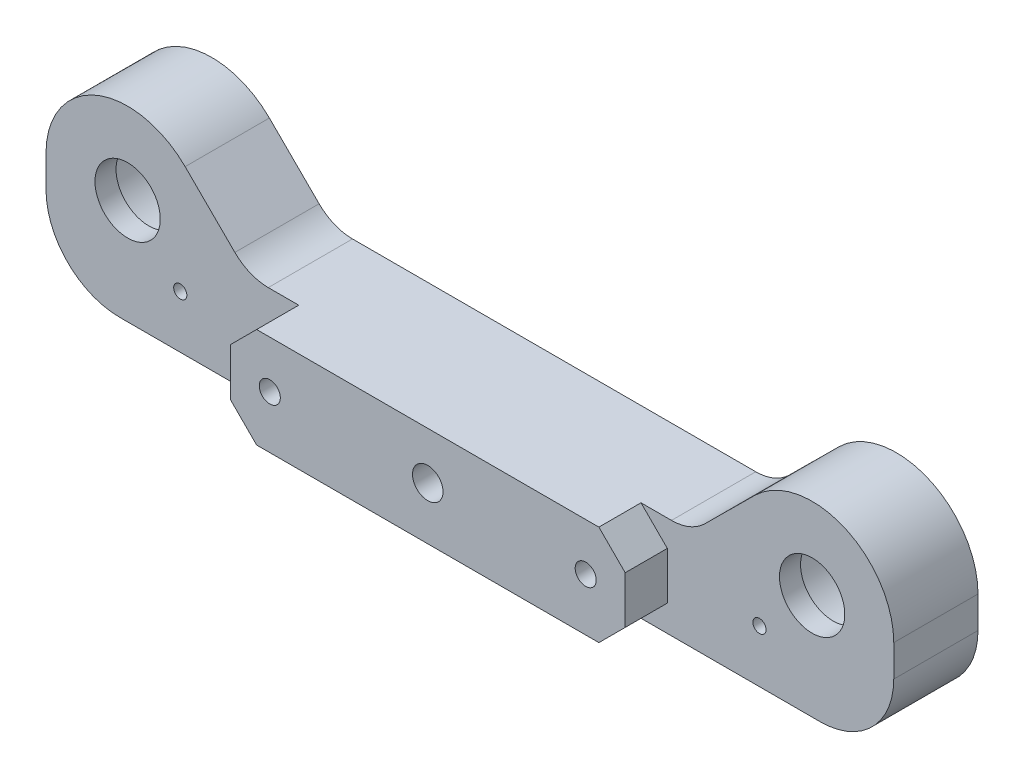
ISO-10303-21;
HEADER;
FILE_DESCRIPTION(('STEP AP214'),'2;1');
FILE_NAME('part.step','',(''),(''),'','','');
FILE_SCHEMA(('AUTOMOTIVE_DESIGN { 1 0 10303 214 1 1 1 1 }'));
ENDSEC;
DATA;
#1=APPLICATION_CONTEXT('core data for automotive mechanical design processes');
#2=APPLICATION_PROTOCOL_DEFINITION('international standard','automotive_design',2000,#1);
#3=PRODUCT_CONTEXT('',#1,'mechanical');
#4=PRODUCT('Part','Part','',(#3));
#5=PRODUCT_RELATED_PRODUCT_CATEGORY('part','',(#4));
#6=PRODUCT_DEFINITION_FORMATION('','',#4);
#7=PRODUCT_DEFINITION_CONTEXT('part definition',#1,'design');
#8=PRODUCT_DEFINITION('design','',#6,#7);
#9=PRODUCT_DEFINITION_SHAPE('','',#8);
#10=(LENGTH_UNIT() NAMED_UNIT(*) SI_UNIT(.MILLI.,.METRE.));
#11=(NAMED_UNIT(*) PLANE_ANGLE_UNIT() SI_UNIT($,.RADIAN.));
#12=(NAMED_UNIT(*) SI_UNIT($,.STERADIAN.) SOLID_ANGLE_UNIT());
#13=UNCERTAINTY_MEASURE_WITH_UNIT(LENGTH_MEASURE(1.E-05),#10,'distance_accuracy_value','');
#14=(GEOMETRIC_REPRESENTATION_CONTEXT(3) GLOBAL_UNCERTAINTY_ASSIGNED_CONTEXT((#13)) GLOBAL_UNIT_ASSIGNED_CONTEXT((#10,
#11,#12)) REPRESENTATION_CONTEXT('',''));
#15=CARTESIAN_POINT('',(0.,0.,0.));
#16=DIRECTION('',(0.,0.,1.));
#17=DIRECTION('',(1.,0.,0.));
#18=AXIS2_PLACEMENT_3D('',#15,#16,#17);
#19=CARTESIAN_POINT('',(-16.25,4.5,-12.));
#20=DIRECTION('',(-0.707106781186544,0.707106781186551,0.));
#21=DIRECTION('',(-0.707106781186551,-0.707106781186544,0.));
#22=AXIS2_PLACEMENT_3D('',#19,#20,#21);
#23=PLANE('',#22);
#24=DIRECTION('',(-0.707106781186551,-0.707106781186544,0.));
#25=VECTOR('',#24,1.);
#26=CARTESIAN_POINT('',(-16.25,4.5,-4.));
#27=LINE('',#26,#25);
#28=CARTESIAN_POINT('',(-16.25,4.5,-4.));
#29=VERTEX_POINT('',#28);
#30=CARTESIAN_POINT('',(-18.75,1.99999999999998,-4.));
#31=VERTEX_POINT('',#30);
#32=EDGE_CURVE('E415',#29,#31,#27,.T.);
#33=ORIENTED_EDGE('',*,*,#32,.T.);
#34=DIRECTION('',(0.,0.,1.));
#35=VECTOR('',#34,1.);
#36=CARTESIAN_POINT('',(-18.75,1.99999999999998,0.));
#37=LINE('',#36,#35);
#38=CARTESIAN_POINT('',(-18.75,1.99999999999997,0.));
#39=VERTEX_POINT('',#38);
#40=EDGE_CURVE('E311',#31,#39,#37,.T.);
#41=ORIENTED_EDGE('',*,*,#40,.T.);
#42=DIRECTION('',(0.707106781186551,0.707106781186544,0.));
#43=VECTOR('',#42,1.);
#44=CARTESIAN_POINT('',(2.87500000000018,23.6249999999999,0.));
#45=LINE('',#44,#43);
#46=CARTESIAN_POINT('',(-16.25,4.5,0.));
#47=VERTEX_POINT('',#46);
#48=EDGE_CURVE('E356',#39,#47,#45,.T.);
#49=ORIENTED_EDGE('',*,*,#48,.T.);
#50=DIRECTION('',(0.,0.,-1.));
#51=VECTOR('',#50,1.);
#52=CARTESIAN_POINT('',(-16.25,4.5,-12.));
#53=LINE('',#52,#51);
#54=EDGE_CURVE('E325',#47,#29,#53,.T.);
#55=ORIENTED_EDGE('',*,*,#54,.T.);
#56=EDGE_LOOP('',(#33,#41,#49,#55));
#57=FACE_BOUND('',#56,.T.);
#58=ADVANCED_FACE('F42',(#57),#23,.T.);
#59=CARTESIAN_POINT('',(16.25,4.5,-12.));
#60=DIRECTION('',(0.707106781186544,0.707106781186551,0.));
#61=DIRECTION('',(-0.707106781186551,0.707106781186544,0.));
#62=AXIS2_PLACEMENT_3D('',#59,#60,#61);
#63=PLANE('',#62);
#64=DIRECTION('',(0.,0.,1.));
#65=VECTOR('',#64,1.);
#66=CARTESIAN_POINT('',(16.25,4.5,0.));
#67=LINE('',#66,#65);
#68=CARTESIAN_POINT('',(16.25,4.5,-4.));
#69=VERTEX_POINT('',#68);
#70=CARTESIAN_POINT('',(16.25,4.5,0.));
#71=VERTEX_POINT('',#70);
#72=EDGE_CURVE('E271',#69,#71,#67,.T.);
#73=ORIENTED_EDGE('',*,*,#72,.T.);
#74=DIRECTION('',(0.707106781186551,-0.707106781186544,0.));
#75=VECTOR('',#74,1.);
#76=CARTESIAN_POINT('',(12.125,8.62499999999995,0.));
#77=LINE('',#76,#75);
#78=CARTESIAN_POINT('',(18.75,1.99999999999998,0.));
#79=VERTEX_POINT('',#78);
#80=EDGE_CURVE('E339',#71,#79,#77,.T.);
#81=ORIENTED_EDGE('',*,*,#80,.T.);
#82=DIRECTION('',(0.,0.,-1.));
#83=VECTOR('',#82,1.);
#84=CARTESIAN_POINT('',(18.75,1.99999999999998,-12.));
#85=LINE('',#84,#83);
#86=CARTESIAN_POINT('',(18.75,1.99999999999998,-4.));
#87=VERTEX_POINT('',#86);
#88=EDGE_CURVE('E320',#79,#87,#85,.T.);
#89=ORIENTED_EDGE('',*,*,#88,.T.);
#90=DIRECTION('',(-0.707106781186551,0.707106781186544,0.));
#91=VECTOR('',#90,1.);
#92=CARTESIAN_POINT('',(16.25,4.5,-4.));
#93=LINE('',#92,#91);
#94=EDGE_CURVE('E275',#87,#69,#93,.T.);
#95=ORIENTED_EDGE('',*,*,#94,.T.);
#96=EDGE_LOOP('',(#73,#81,#89,#95));
#97=FACE_BOUND('',#96,.T.);
#98=ADVANCED_FACE('F337',(#97),#63,.T.);
#99=CARTESIAN_POINT('',(15.,0.,-12.));
#100=DIRECTION('',(0.,0.,-1.));
#101=DIRECTION('',(1.,0.,0.));
#102=AXIS2_PLACEMENT_3D('',#99,#100,#101);
#103=CYLINDRICAL_SURFACE('',#102,0.999999999999997);
#104=CARTESIAN_POINT('',(15.,0.,0.));
#105=DIRECTION('',(0.,0.,-1.));
#106=DIRECTION('',(-1.,0.,0.));
#107=AXIS2_PLACEMENT_3D('',#104,#105,#106);
#108=CIRCLE('',#107,0.999999999999997);
#109=CARTESIAN_POINT('',(14.,0.,0.));
#110=VERTEX_POINT('',#109);
#111=EDGE_CURVE('E377',#110,#110,#108,.T.);
#112=ORIENTED_EDGE('',*,*,#111,.F.);
#113=EDGE_LOOP('',(#112));
#114=FACE_BOUND('',#113,.T.);
#115=CARTESIAN_POINT('',(15.,0.,-10.));
#116=DIRECTION('',(0.,0.,1.));
#117=DIRECTION('',(1.,0.,0.));
#118=AXIS2_PLACEMENT_3D('',#115,#116,#117);
#119=CIRCLE('',#118,0.999999999999997);
#120=CARTESIAN_POINT('',(16.,0.,-10.));
#121=VERTEX_POINT('',#120);
#122=EDGE_CURVE('E418',#121,#121,#119,.F.);
#123=ORIENTED_EDGE('',*,*,#122,.T.);
#124=EDGE_LOOP('',(#123));
#125=FACE_BOUND('',#124,.T.);
#126=ADVANCED_FACE('F492',(#114,#125),#103,.F.);
#127=CARTESIAN_POINT('',(-15.,0.,-12.));
#128=DIRECTION('',(0.,0.,-1.));
#129=DIRECTION('',(1.,0.,0.));
#130=AXIS2_PLACEMENT_3D('',#127,#128,#129);
#131=CYLINDRICAL_SURFACE('',#130,0.999999999999991);
#132=CARTESIAN_POINT('',(-15.,0.,0.));
#133=DIRECTION('',(0.,0.,-1.));
#134=DIRECTION('',(-1.,0.,0.));
#135=AXIS2_PLACEMENT_3D('',#132,#133,#134);
#136=CIRCLE('',#135,0.999999999999991);
#137=CARTESIAN_POINT('',(-16.,0.,0.));
#138=VERTEX_POINT('',#137);
#139=EDGE_CURVE('E534',#138,#138,#136,.T.);
#140=ORIENTED_EDGE('',*,*,#139,.F.);
#141=EDGE_LOOP('',(#140));
#142=FACE_BOUND('',#141,.T.);
#143=CARTESIAN_POINT('',(-15.,0.,-10.));
#144=DIRECTION('',(0.,0.,1.));
#145=DIRECTION('',(1.,0.,0.));
#146=AXIS2_PLACEMENT_3D('',#143,#144,#145);
#147=CIRCLE('',#146,0.999999999999991);
#148=CARTESIAN_POINT('',(-14.,0.,-10.));
#149=VERTEX_POINT('',#148);
#150=EDGE_CURVE('E416',#149,#149,#147,.F.);
#151=ORIENTED_EDGE('',*,*,#150,.T.);
#152=EDGE_LOOP('',(#151));
#153=FACE_BOUND('',#152,.T.);
#154=ADVANCED_FACE('F482',(#142,#153),#131,.F.);
#155=CARTESIAN_POINT('',(0.,0.,-12.));
#156=DIRECTION('',(0.,0.,-1.));
#157=DIRECTION('',(1.,0.,0.));
#158=AXIS2_PLACEMENT_3D('',#155,#156,#157);
#159=CYLINDRICAL_SURFACE('',#158,1.45);
#160=CARTESIAN_POINT('',(0.,0.,0.));
#161=DIRECTION('',(0.,0.,-1.));
#162=DIRECTION('',(-1.,0.,0.));
#163=AXIS2_PLACEMENT_3D('',#160,#161,#162);
#164=CIRCLE('',#163,1.45);
#165=CARTESIAN_POINT('',(-1.45,0.,0.));
#166=VERTEX_POINT('',#165);
#167=EDGE_CURVE('E349',#166,#166,#164,.T.);
#168=ORIENTED_EDGE('',*,*,#167,.F.);
#169=EDGE_LOOP('',(#168));
#170=FACE_BOUND('',#169,.T.);
#171=CARTESIAN_POINT('',(0.,0.,-7.5));
#172=DIRECTION('',(0.,0.,1.));
#173=DIRECTION('',(1.,0.,0.));
#174=AXIS2_PLACEMENT_3D('',#171,#172,#173);
#175=CIRCLE('',#174,1.45);
#176=CARTESIAN_POINT('',(1.45,0.,-7.5));
#177=VERTEX_POINT('',#176);
#178=EDGE_CURVE('E387',#177,#177,#175,.F.);
#179=ORIENTED_EDGE('',*,*,#178,.T.);
#180=EDGE_LOOP('',(#179));
#181=FACE_BOUND('',#180,.T.);
#182=ADVANCED_FACE('F473',(#170,#181),#159,.F.);
#183=CARTESIAN_POINT('',(-32.5,5.,-22.));
#184=DIRECTION('',(0.,0.,1.));
#185=DIRECTION('',(-1.,0.,0.));
#186=AXIS2_PLACEMENT_3D('',#183,#184,#185);
#187=CYLINDRICAL_SURFACE('',#186,3.1);
#188=CARTESIAN_POINT('',(-32.5,5.,-6.));
#189=DIRECTION('',(0.,0.,1.));
#190=DIRECTION('',(1.,0.,0.));
#191=AXIS2_PLACEMENT_3D('',#188,#189,#190);
#192=CIRCLE('',#191,3.1);
#193=CARTESIAN_POINT('',(-29.4,5.,-6.));
#194=VERTEX_POINT('',#193);
#195=EDGE_CURVE('E379',#194,#194,#192,.T.);
#196=ORIENTED_EDGE('',*,*,#195,.F.);
#197=EDGE_LOOP('',(#196));
#198=FACE_BOUND('',#197,.T.);
#199=CARTESIAN_POINT('',(-32.5,5.,-4.));
#200=DIRECTION('',(0.,0.,-1.));
#201=DIRECTION('',(-1.,0.,0.));
#202=AXIS2_PLACEMENT_3D('',#199,#200,#201);
#203=CIRCLE('',#202,3.1);
#204=CARTESIAN_POINT('',(-35.6,5.,-4.));
#205=VERTEX_POINT('',#204);
#206=EDGE_CURVE('E287',#205,#205,#203,.T.);
#207=ORIENTED_EDGE('',*,*,#206,.F.);
#208=EDGE_LOOP('',(#207));
#209=FACE_BOUND('',#208,.T.);
#210=ADVANCED_FACE('F470',(#198,#209),#187,.F.);
#211=CARTESIAN_POINT('',(32.5,5.,-22.));
#212=DIRECTION('',(0.,0.,1.));
#213=DIRECTION('',(-1.,0.,0.));
#214=AXIS2_PLACEMENT_3D('',#211,#212,#213);
#215=CYLINDRICAL_SURFACE('',#214,3.1);
#216=CARTESIAN_POINT('',(32.5,5.,-6.));
#217=DIRECTION('',(0.,0.,1.));
#218=DIRECTION('',(1.,0.,0.));
#219=AXIS2_PLACEMENT_3D('',#216,#217,#218);
#220=CIRCLE('',#219,3.1);
#221=CARTESIAN_POINT('',(35.6,5.,-6.));
#222=VERTEX_POINT('',#221);
#223=EDGE_CURVE('E374',#222,#222,#220,.T.);
#224=ORIENTED_EDGE('',*,*,#223,.F.);
#225=EDGE_LOOP('',(#224));
#226=FACE_BOUND('',#225,.T.);
#227=CARTESIAN_POINT('',(32.5,5.,-4.));
#228=DIRECTION('',(0.,0.,-1.));
#229=DIRECTION('',(-1.,0.,0.));
#230=AXIS2_PLACEMENT_3D('',#227,#228,#229);
#231=CIRCLE('',#230,3.1);
#232=CARTESIAN_POINT('',(29.4,5.,-4.));
#233=VERTEX_POINT('',#232);
#234=EDGE_CURVE('E286',#233,#233,#231,.T.);
#235=ORIENTED_EDGE('',*,*,#234,.F.);
#236=EDGE_LOOP('',(#235));
#237=FACE_BOUND('',#236,.T.);
#238=ADVANCED_FACE('F472',(#226,#237),#215,.F.);
#239=CARTESIAN_POINT('',(-39.25,3.49999999999999,-12.));
#240=DIRECTION('',(0.,0.,-1.));
#241=DIRECTION('',(1.,0.,0.));
#242=AXIS2_PLACEMENT_3D('',#239,#240,#241);
#243=PLANE('',#242);
#244=DIRECTION('',(0.,1.,0.));
#245=VECTOR('',#244,1.);
#246=CARTESIAN_POINT('',(-40.25,-5.,-12.));
#247=LINE('',#246,#245);
#248=CARTESIAN_POINT('',(-40.25,2.,-12.));
#249=VERTEX_POINT('',#248);
#250=CARTESIAN_POINT('',(-40.25,5.,-12.));
#251=VERTEX_POINT('',#250);
#252=EDGE_CURVE('E841',#249,#251,#247,.T.);
#253=ORIENTED_EDGE('',*,*,#252,.T.);
#254=CARTESIAN_POINT('',(-32.5,5.,-12.));
#255=DIRECTION('',(0.,0.,1.));
#256=DIRECTION('',(1.,0.,0.));
#257=AXIS2_PLACEMENT_3D('',#254,#255,#256);
#258=CIRCLE('',#257,7.75000000000001);
#259=CARTESIAN_POINT('',(-27.038121046959,10.4982159199442,-12.));
#260=VERTEX_POINT('',#259);
#261=EDGE_CURVE('E202',#251,#260,#258,.F.);
#262=ORIENTED_EDGE('',*,*,#261,.T.);
#263=DIRECTION('',(0.709447215476664,-0.704758574585941,0.));
#264=VECTOR('',#263,1.);
#265=CARTESIAN_POINT('',(-27.038121046959,10.4982159199442,-12.));
#266=LINE('',#265,#264);
#267=CARTESIAN_POINT('',(-22.316186026152,5.80748753035501,-12.));
#268=VERTEX_POINT('',#267);
#269=EDGE_CURVE('E230',#260,#268,#266,.T.);
#270=ORIENTED_EDGE('',*,*,#269,.T.);
#271=CARTESIAN_POINT('',(-19.1447724405153,9.,-12.));
#272=DIRECTION('',(0.,0.,1.));
#273=DIRECTION('',(1.,0.,0.));
#274=AXIS2_PLACEMENT_3D('',#271,#272,#273);
#275=CIRCLE('',#274,4.5);
#276=CARTESIAN_POINT('',(-19.1447724405153,4.5,-12.));
#277=VERTEX_POINT('',#276);
#278=EDGE_CURVE('E441',#277,#268,#275,.F.);
#279=ORIENTED_EDGE('',*,*,#278,.F.);
#280=DIRECTION('',(1.,0.,0.));
#281=VECTOR('',#280,1.);
#282=CARTESIAN_POINT('',(-18.75,4.5,-12.));
#283=LINE('',#282,#281);
#284=CARTESIAN_POINT('',(19.1447724405153,4.5,-12.));
#285=VERTEX_POINT('',#284);
#286=EDGE_CURVE('E350',#277,#285,#283,.T.);
#287=ORIENTED_EDGE('',*,*,#286,.T.);
#288=CARTESIAN_POINT('',(19.1447724405153,9.,-12.));
#289=DIRECTION('',(0.,0.,1.));
#290=DIRECTION('',(1.,0.,0.));
#291=AXIS2_PLACEMENT_3D('',#288,#289,#290);
#292=CIRCLE('',#291,4.5);
#293=CARTESIAN_POINT('',(22.316186026152,5.80748753035501,-12.));
#294=VERTEX_POINT('',#293);
#295=EDGE_CURVE('E435',#294,#285,#292,.F.);
#296=ORIENTED_EDGE('',*,*,#295,.F.);
#297=DIRECTION('',(0.709447215476664,0.704758574585941,0.));
#298=VECTOR('',#297,1.);
#299=CARTESIAN_POINT('',(27.038121046959,10.4982159199442,-12.));
#300=LINE('',#299,#298);
#301=CARTESIAN_POINT('',(27.0381210469589,10.4982159199441,-12.));
#302=VERTEX_POINT('',#301);
#303=EDGE_CURVE('E199',#294,#302,#300,.T.);
#304=ORIENTED_EDGE('',*,*,#303,.T.);
#305=CARTESIAN_POINT('',(32.5,5.,-12.));
#306=DIRECTION('',(0.,0.,1.));
#307=DIRECTION('',(1.,0.,0.));
#308=AXIS2_PLACEMENT_3D('',#305,#306,#307);
#309=CIRCLE('',#308,7.75000000000001);
#310=CARTESIAN_POINT('',(40.25,5.,-12.));
#311=VERTEX_POINT('',#310);
#312=EDGE_CURVE('E180',#302,#311,#309,.F.);
#313=ORIENTED_EDGE('',*,*,#312,.T.);
#314=DIRECTION('',(0.,-1.,0.));
#315=VECTOR('',#314,1.);
#316=CARTESIAN_POINT('',(40.25,-5.,-12.));
#317=LINE('',#316,#315);
#318=CARTESIAN_POINT('',(40.25,2.00000000000001,-12.));
#319=VERTEX_POINT('',#318);
#320=EDGE_CURVE('E185',#311,#319,#317,.T.);
#321=ORIENTED_EDGE('',*,*,#320,.T.);
#322=CARTESIAN_POINT('',(33.25,2.,-12.));
#323=DIRECTION('',(0.,0.,1.));
#324=DIRECTION('',(1.,0.,0.));
#325=AXIS2_PLACEMENT_3D('',#322,#323,#324);
#326=CIRCLE('',#325,7.);
#327=CARTESIAN_POINT('',(33.25,-5.,-12.));
#328=VERTEX_POINT('',#327);
#329=EDGE_CURVE('E519',#328,#319,#326,.T.);
#330=ORIENTED_EDGE('',*,*,#329,.F.);
#331=DIRECTION('',(-1.,0.,0.));
#332=VECTOR('',#331,1.);
#333=CARTESIAN_POINT('',(39.25,-5.,-12.));
#334=LINE('',#333,#332);
#335=CARTESIAN_POINT('',(-33.25,-5.,-12.));
#336=VERTEX_POINT('',#335);
#337=EDGE_CURVE('E296',#328,#336,#334,.T.);
#338=ORIENTED_EDGE('',*,*,#337,.T.);
#339=CARTESIAN_POINT('',(-33.25,2.,-12.));
#340=DIRECTION('',(0.,0.,1.));
#341=DIRECTION('',(1.,0.,0.));
#342=AXIS2_PLACEMENT_3D('',#339,#340,#341);
#343=CIRCLE('',#342,7.);
#344=EDGE_CURVE('E516',#249,#336,#343,.T.);
#345=ORIENTED_EDGE('',*,*,#344,.F.);
#346=EDGE_LOOP('',(#253,#262,#270,#279,#287,#296,#304,#313,#321,#330,#338,#345));
#347=FACE_BOUND('',#346,.T.);
#348=CARTESIAN_POINT('',(-27.5000005327804,0.00437002060559369,-12.));
#349=DIRECTION('',(0.,0.,1.));
#350=DIRECTION('',(1.,0.,0.));
#351=AXIS2_PLACEMENT_3D('',#348,#349,#350);
#352=CIRCLE('',#351,0.624999999999997);
#353=CARTESIAN_POINT('',(-26.8750005327804,0.00437002060559369,-12.));
#354=VERTEX_POINT('',#353);
#355=EDGE_CURVE('E260',#354,#354,#352,.T.);
#356=ORIENTED_EDGE('',*,*,#355,.T.);
#357=EDGE_LOOP('',(#356));
#358=FACE_BOUND('',#357,.T.);
#359=CARTESIAN_POINT('',(27.4999979927804,-0.0043700202019166,-12.));
#360=DIRECTION('',(0.,0.,1.));
#361=DIRECTION('',(1.,0.,0.));
#362=AXIS2_PLACEMENT_3D('',#359,#360,#361);
#363=CIRCLE('',#362,0.624999999999997);
#364=CARTESIAN_POINT('',(28.1249979927804,-0.0043700202019166,-12.));
#365=VERTEX_POINT('',#364);
#366=EDGE_CURVE('E253',#365,#365,#363,.T.);
#367=ORIENTED_EDGE('',*,*,#366,.T.);
#368=EDGE_LOOP('',(#367));
#369=FACE_BOUND('',#368,.T.);
#370=CARTESIAN_POINT('',(0.,0.,-12.));
#371=DIRECTION('',(0.,0.,1.));
#372=DIRECTION('',(1.,0.,0.));
#373=AXIS2_PLACEMENT_3D('',#370,#371,#372);
#374=CIRCLE('',#373,1.95);
#375=CARTESIAN_POINT('',(1.95,0.,-12.));
#376=VERTEX_POINT('',#375);
#377=EDGE_CURVE('E211',#376,#376,#374,.T.);
#378=ORIENTED_EDGE('',*,*,#377,.T.);
#379=EDGE_LOOP('',(#378));
#380=FACE_BOUND('',#379,.T.);
#381=CARTESIAN_POINT('',(-32.5,5.,-12.));
#382=DIRECTION('',(0.,0.,-1.));
#383=DIRECTION('',(-1.,0.,0.));
#384=AXIS2_PLACEMENT_3D('',#381,#382,#383);
#385=CIRCLE('',#384,4.75);
#386=CARTESIAN_POINT('',(-37.25,5.,-12.));
#387=VERTEX_POINT('',#386);
#388=EDGE_CURVE('E521',#387,#387,#385,.T.);
#389=ORIENTED_EDGE('',*,*,#388,.F.);
#390=EDGE_LOOP('',(#389));
#391=FACE_BOUND('',#390,.T.);
#392=CARTESIAN_POINT('',(32.5,5.,-12.));
#393=DIRECTION('',(0.,0.,1.));
#394=DIRECTION('',(1.,0.,0.));
#395=AXIS2_PLACEMENT_3D('',#392,#393,#394);
#396=CIRCLE('',#395,4.75);
#397=CARTESIAN_POINT('',(37.25,5.,-12.));
#398=VERTEX_POINT('',#397);
#399=EDGE_CURVE('E381',#398,#398,#396,.T.);
#400=ORIENTED_EDGE('',*,*,#399,.T.);
#401=EDGE_LOOP('',(#400));
#402=FACE_BOUND('',#401,.T.);
#403=ADVANCED_FACE('F195',(#347,#358,#369,#380,#391,#402),#243,.T.);
#404=CARTESIAN_POINT('',(-18.75,-3.50000000000001,3.15));
#405=DIRECTION('',(1.,0.,0.));
#406=DIRECTION('',(0.,1.,0.));
#407=AXIS2_PLACEMENT_3D('',#404,#405,#406);
#408=PLANE('',#407);
#409=DIRECTION('',(0.,-1.,0.));
#410=VECTOR('',#409,1.);
#411=CARTESIAN_POINT('',(-18.75,-3.50000000000001,0.));
#412=LINE('',#411,#410);
#413=CARTESIAN_POINT('',(-18.75,-2.49999999999999,0.));
#414=VERTEX_POINT('',#413);
#415=EDGE_CURVE('E372',#39,#414,#412,.T.);
#416=ORIENTED_EDGE('',*,*,#415,.F.);
#417=ORIENTED_EDGE('',*,*,#40,.F.);
#418=DIRECTION('',(0.,-1.,0.));
#419=VECTOR('',#418,1.);
#420=CARTESIAN_POINT('',(-18.75,-5.,-4.));
#421=LINE('',#420,#419);
#422=CARTESIAN_POINT('',(-18.75,-2.49999999999999,-4.));
#423=VERTEX_POINT('',#422);
#424=EDGE_CURVE('E459',#31,#423,#421,.T.);
#425=ORIENTED_EDGE('',*,*,#424,.T.);
#426=DIRECTION('',(0.,0.,-1.));
#427=VECTOR('',#426,1.);
#428=CARTESIAN_POINT('',(-18.75,-2.49999999999999,-4.));
#429=LINE('',#428,#427);
#430=EDGE_CURVE('E317',#414,#423,#429,.T.);
#431=ORIENTED_EDGE('',*,*,#430,.F.);
#432=EDGE_LOOP('',(#416,#417,#425,#431));
#433=FACE_BOUND('',#432,.T.);
#434=ADVANCED_FACE('F604',(#433),#408,.F.);
#435=CARTESIAN_POINT('',(18.75,-3.50000000000001,3.15));
#436=DIRECTION('',(-1.,0.,0.));
#437=DIRECTION('',(0.,-1.,0.));
#438=AXIS2_PLACEMENT_3D('',#435,#436,#437);
#439=PLANE('',#438);
#440=DIRECTION('',(0.,1.,0.));
#441=VECTOR('',#440,1.);
#442=CARTESIAN_POINT('',(18.75,-5.,-4.));
#443=LINE('',#442,#441);
#444=CARTESIAN_POINT('',(18.75,-2.49999999999998,-4.));
#445=VERTEX_POINT('',#444);
#446=EDGE_CURVE('E284',#445,#87,#443,.T.);
#447=ORIENTED_EDGE('',*,*,#446,.T.);
#448=ORIENTED_EDGE('',*,*,#88,.F.);
#449=DIRECTION('',(0.,-1.,0.));
#450=VECTOR('',#449,1.);
#451=CARTESIAN_POINT('',(18.75,-3.50000000000001,0.));
#452=LINE('',#451,#450);
#453=CARTESIAN_POINT('',(18.75,-2.49999999999998,0.));
#454=VERTEX_POINT('',#453);
#455=EDGE_CURVE('E354',#79,#454,#452,.T.);
#456=ORIENTED_EDGE('',*,*,#455,.T.);
#457=DIRECTION('',(0.,0.,1.));
#458=VECTOR('',#457,1.);
#459=CARTESIAN_POINT('',(18.75,-2.49999999999998,0.));
#460=LINE('',#459,#458);
#461=EDGE_CURVE('E323',#445,#454,#460,.T.);
#462=ORIENTED_EDGE('',*,*,#461,.F.);
#463=EDGE_LOOP('',(#447,#448,#456,#462));
#464=FACE_BOUND('',#463,.T.);
#465=ADVANCED_FACE('F411',(#464),#439,.F.);
#466=CARTESIAN_POINT('',(15.,11.5,0.));
#467=DIRECTION('',(0.,0.,1.));
#468=DIRECTION('',(-1.,0.,0.));
#469=AXIS2_PLACEMENT_3D('',#466,#467,#468);
#470=PLANE('',#469);
#471=ORIENTED_EDGE('',*,*,#167,.T.);
#472=EDGE_LOOP('',(#471));
#473=FACE_BOUND('',#472,.T.);
#474=ORIENTED_EDGE('',*,*,#111,.T.);
#475=EDGE_LOOP('',(#474));
#476=FACE_BOUND('',#475,.T.);
#477=ORIENTED_EDGE('',*,*,#139,.T.);
#478=EDGE_LOOP('',(#477));
#479=FACE_BOUND('',#478,.T.);
#480=DIRECTION('',(1.,0.,0.));
#481=VECTOR('',#480,1.);
#482=CARTESIAN_POINT('',(-18.75,-5.,0.));
#483=LINE('',#482,#481);
#484=CARTESIAN_POINT('',(-16.25,-5.,0.));
#485=VERTEX_POINT('',#484);
#486=CARTESIAN_POINT('',(16.25,-5.,0.));
#487=VERTEX_POINT('',#486);
#488=EDGE_CURVE('E292',#485,#487,#483,.T.);
#489=ORIENTED_EDGE('',*,*,#488,.T.);
#490=DIRECTION('',(-0.707106781186546,-0.707106781186549,0.));
#491=VECTOR('',#490,1.);
#492=CARTESIAN_POINT('',(23.875,2.62500000000004,0.));
#493=LINE('',#492,#491);
#494=EDGE_CURVE('E312',#454,#487,#493,.T.);
#495=ORIENTED_EDGE('',*,*,#494,.F.);
#496=ORIENTED_EDGE('',*,*,#455,.F.);
#497=ORIENTED_EDGE('',*,*,#80,.F.);
#498=DIRECTION('',(-1.,0.,0.));
#499=VECTOR('',#498,1.);
#500=CARTESIAN_POINT('',(-18.75,4.5,0.));
#501=LINE('',#500,#499);
#502=EDGE_CURVE('E346',#71,#47,#501,.T.);
#503=ORIENTED_EDGE('',*,*,#502,.T.);
#504=ORIENTED_EDGE('',*,*,#48,.F.);
#505=ORIENTED_EDGE('',*,*,#415,.T.);
#506=DIRECTION('',(-0.707106781186547,0.707106781186548,0.));
#507=VECTOR('',#506,1.);
#508=CARTESIAN_POINT('',(-8.87500000000001,-12.375,0.));
#509=LINE('',#508,#507);
#510=EDGE_CURVE('E307',#485,#414,#509,.T.);
#511=ORIENTED_EDGE('',*,*,#510,.F.);
#512=EDGE_LOOP('',(#489,#495,#496,#497,#503,#504,#505,#511));
#513=FACE_BOUND('',#512,.T.);
#514=ADVANCED_FACE('F352',(#473,#476,#479,#513),#470,.T.);
#515=CARTESIAN_POINT('',(32.5,5.,-6.));
#516=DIRECTION('',(0.,0.,-1.));
#517=DIRECTION('',(1.,0.,0.));
#518=AXIS2_PLACEMENT_3D('',#515,#516,#517);
#519=CYLINDRICAL_SURFACE('',#518,4.75);
#520=CARTESIAN_POINT('',(32.5,5.,-6.));
#521=DIRECTION('',(0.,0.,1.));
#522=DIRECTION('',(1.,0.,0.));
#523=AXIS2_PLACEMENT_3D('',#520,#521,#522);
#524=CIRCLE('',#523,4.75);
#525=CARTESIAN_POINT('',(37.25,5.,-6.));
#526=VERTEX_POINT('',#525);
#527=EDGE_CURVE('E378',#526,#526,#524,.T.);
#528=ORIENTED_EDGE('',*,*,#527,.T.);
#529=EDGE_LOOP('',(#528));
#530=FACE_BOUND('',#529,.T.);
#531=ORIENTED_EDGE('',*,*,#399,.F.);
#532=EDGE_LOOP('',(#531));
#533=FACE_BOUND('',#532,.T.);
#534=ADVANCED_FACE('F591',(#530,#533),#519,.F.);
#535=CARTESIAN_POINT('',(32.5,5.,-6.));
#536=DIRECTION('',(0.,0.,-1.));
#537=DIRECTION('',(1.,0.,0.));
#538=AXIS2_PLACEMENT_3D('',#535,#536,#537);
#539=PLANE('',#538);
#540=ORIENTED_EDGE('',*,*,#223,.T.);
#541=EDGE_LOOP('',(#540));
#542=FACE_BOUND('',#541,.T.);
#543=ORIENTED_EDGE('',*,*,#527,.F.);
#544=EDGE_LOOP('',(#543));
#545=FACE_BOUND('',#544,.T.);
#546=ADVANCED_FACE('F587',(#542,#545),#539,.T.);
#547=CARTESIAN_POINT('',(-32.5,5.,-6.));
#548=DIRECTION('',(0.,0.,-1.));
#549=DIRECTION('',(1.,0.,0.));
#550=AXIS2_PLACEMENT_3D('',#547,#548,#549);
#551=CYLINDRICAL_SURFACE('',#550,4.75);
#552=CARTESIAN_POINT('',(-32.5,5.,-6.));
#553=DIRECTION('',(0.,0.,-1.));
#554=DIRECTION('',(-1.,0.,0.));
#555=AXIS2_PLACEMENT_3D('',#552,#553,#554);
#556=CIRCLE('',#555,4.75);
#557=CARTESIAN_POINT('',(-37.25,5.,-6.));
#558=VERTEX_POINT('',#557);
#559=EDGE_CURVE('E382',#558,#558,#556,.T.);
#560=ORIENTED_EDGE('',*,*,#559,.F.);
#561=EDGE_LOOP('',(#560));
#562=FACE_BOUND('',#561,.T.);
#563=ORIENTED_EDGE('',*,*,#388,.T.);
#564=EDGE_LOOP('',(#563));
#565=FACE_BOUND('',#564,.T.);
#566=ADVANCED_FACE('F583',(#562,#565),#551,.F.);
#567=CARTESIAN_POINT('',(-32.5,5.,-6.));
#568=DIRECTION('',(0.,0.,-1.));
#569=DIRECTION('',(-1.,0.,0.));
#570=AXIS2_PLACEMENT_3D('',#567,#568,#569);
#571=PLANE('',#570);
#572=ORIENTED_EDGE('',*,*,#195,.T.);
#573=EDGE_LOOP('',(#572));
#574=FACE_BOUND('',#573,.T.);
#575=ORIENTED_EDGE('',*,*,#559,.T.);
#576=EDGE_LOOP('',(#575));
#577=FACE_BOUND('',#576,.T.);
#578=ADVANCED_FACE('F580',(#574,#577),#571,.T.);
#579=CARTESIAN_POINT('',(-18.75,-5.,0.));
#580=DIRECTION('',(0.,-1.,0.));
#581=DIRECTION('',(1.,0.,0.));
#582=AXIS2_PLACEMENT_3D('',#579,#580,#581);
#583=PLANE('',#582);
#584=ORIENTED_EDGE('',*,*,#337,.F.);
#585=DIRECTION('',(0.,0.,1.));
#586=VECTOR('',#585,1.);
#587=CARTESIAN_POINT('',(33.25,-5.,0.));
#588=LINE('',#587,#586);
#589=CARTESIAN_POINT('',(33.25,-5.,-4.));
#590=VERTEX_POINT('',#589);
#591=EDGE_CURVE('E444',#590,#328,#588,.F.);
#592=ORIENTED_EDGE('',*,*,#591,.F.);
#593=DIRECTION('',(1.,0.,0.));
#594=VECTOR('',#593,1.);
#595=CARTESIAN_POINT('',(-18.75,-5.,-4.));
#596=LINE('',#595,#594);
#597=CARTESIAN_POINT('',(16.25,-5.,-4.));
#598=VERTEX_POINT('',#597);
#599=EDGE_CURVE('E371',#598,#590,#596,.T.);
#600=ORIENTED_EDGE('',*,*,#599,.F.);
#601=DIRECTION('',(0.,0.,-1.));
#602=VECTOR('',#601,1.);
#603=CARTESIAN_POINT('',(16.25,-5.,-4.));
#604=LINE('',#603,#602);
#605=EDGE_CURVE('E386',#487,#598,#604,.T.);
#606=ORIENTED_EDGE('',*,*,#605,.F.);
#607=ORIENTED_EDGE('',*,*,#488,.F.);
#608=DIRECTION('',(0.,0.,1.));
#609=VECTOR('',#608,1.);
#610=CARTESIAN_POINT('',(-16.25,-5.,0.));
#611=LINE('',#610,#609);
#612=CARTESIAN_POINT('',(-16.25,-5.,-4.));
#613=VERTEX_POINT('',#612);
#614=EDGE_CURVE('E358',#613,#485,#611,.T.);
#615=ORIENTED_EDGE('',*,*,#614,.F.);
#616=DIRECTION('',(-1.,0.,0.));
#617=VECTOR('',#616,1.);
#618=CARTESIAN_POINT('',(-18.75,-5.,-4.));
#619=LINE('',#618,#617);
#620=CARTESIAN_POINT('',(-33.25,-5.,-4.));
#621=VERTEX_POINT('',#620);
#622=EDGE_CURVE('E456',#613,#621,#619,.T.);
#623=ORIENTED_EDGE('',*,*,#622,.T.);
#624=DIRECTION('',(0.,0.,1.));
#625=VECTOR('',#624,1.);
#626=CARTESIAN_POINT('',(-33.25,-5.,0.));
#627=LINE('',#626,#625);
#628=EDGE_CURVE('E446',#336,#621,#627,.T.);
#629=ORIENTED_EDGE('',*,*,#628,.F.);
#630=EDGE_LOOP('',(#584,#592,#600,#606,#607,#615,#623,#629));
#631=FACE_BOUND('',#630,.T.);
#632=ADVANCED_FACE('F403',(#631),#583,.T.);
#633=CARTESIAN_POINT('',(18.75,15.0715164433417,-4.));
#634=DIRECTION('',(0.,0.,1.));
#635=DIRECTION('',(-1.,0.,0.));
#636=AXIS2_PLACEMENT_3D('',#633,#634,#635);
#637=PLANE('',#636);
#638=DIRECTION('',(0.,-1.,0.));
#639=VECTOR('',#638,1.);
#640=CARTESIAN_POINT('',(40.25,-5.,-4.));
#641=LINE('',#640,#639);
#642=CARTESIAN_POINT('',(40.25,5.,-4.));
#643=VERTEX_POINT('',#642);
#644=CARTESIAN_POINT('',(40.25,2.00000000000001,-4.));
#645=VERTEX_POINT('',#644);
#646=EDGE_CURVE('E186',#643,#645,#641,.T.);
#647=ORIENTED_EDGE('',*,*,#646,.F.);
#648=CARTESIAN_POINT('',(32.5,5.,-4.));
#649=DIRECTION('',(0.,0.,-1.));
#650=DIRECTION('',(1.,0.,0.));
#651=AXIS2_PLACEMENT_3D('',#648,#649,#650);
#652=CIRCLE('',#651,7.75000000000001);
#653=CARTESIAN_POINT('',(27.038121046959,10.4982159199442,-4.));
#654=VERTEX_POINT('',#653);
#655=EDGE_CURVE('E183',#654,#643,#652,.T.);
#656=ORIENTED_EDGE('',*,*,#655,.F.);
#657=DIRECTION('',(0.709447215476664,0.704758574585941,0.));
#658=VECTOR('',#657,1.);
#659=CARTESIAN_POINT('',(27.038121046959,10.4982159199442,-4.));
#660=LINE('',#659,#658);
#661=CARTESIAN_POINT('',(22.316186026152,5.80748753035501,-4.));
#662=VERTEX_POINT('',#661);
#663=EDGE_CURVE('E236',#662,#654,#660,.T.);
#664=ORIENTED_EDGE('',*,*,#663,.F.);
#665=CARTESIAN_POINT('',(19.1447724405153,9.,-4.));
#666=DIRECTION('',(0.,0.,-1.));
#667=DIRECTION('',(-1.,0.,0.));
#668=AXIS2_PLACEMENT_3D('',#665,#666,#667);
#669=CIRCLE('',#668,4.5);
#670=CARTESIAN_POINT('',(19.1447724405153,4.5,-4.));
#671=VERTEX_POINT('',#670);
#672=EDGE_CURVE('E432',#671,#662,#669,.F.);
#673=ORIENTED_EDGE('',*,*,#672,.F.);
#674=DIRECTION('',(1.,0.,0.));
#675=VECTOR('',#674,1.);
#676=CARTESIAN_POINT('',(21.,4.5,-4.));
#677=LINE('',#676,#675);
#678=EDGE_CURVE('E233',#69,#671,#677,.T.);
#679=ORIENTED_EDGE('',*,*,#678,.F.);
#680=ORIENTED_EDGE('',*,*,#94,.F.);
#681=ORIENTED_EDGE('',*,*,#446,.F.);
#682=DIRECTION('',(0.707106781186546,0.707106781186549,0.));
#683=VECTOR('',#682,1.);
#684=CARTESIAN_POINT('',(16.25,-5.,-4.));
#685=LINE('',#684,#683);
#686=EDGE_CURVE('E270',#598,#445,#685,.T.);
#687=ORIENTED_EDGE('',*,*,#686,.F.);
#688=ORIENTED_EDGE('',*,*,#599,.T.);
#689=CARTESIAN_POINT('',(33.25,2.,-4.));
#690=DIRECTION('',(0.,0.,-1.));
#691=DIRECTION('',(-1.,0.,0.));
#692=AXIS2_PLACEMENT_3D('',#689,#690,#691);
#693=CIRCLE('',#692,7.);
#694=EDGE_CURVE('E12',#645,#590,#693,.T.);
#695=ORIENTED_EDGE('',*,*,#694,.F.);
#696=EDGE_LOOP('',(#647,#656,#664,#673,#679,#680,#681,#687,#688,#695));
#697=FACE_BOUND('',#696,.T.);
#698=CARTESIAN_POINT('',(27.4999979927804,-0.0043700202019166,-4.));
#699=DIRECTION('',(0.,0.,-1.));
#700=DIRECTION('',(-1.,0.,0.));
#701=AXIS2_PLACEMENT_3D('',#698,#699,#700);
#702=CIRCLE('',#701,0.624999999999995);
#703=CARTESIAN_POINT('',(26.8749979927804,-0.0043700202019166,-4.));
#704=VERTEX_POINT('',#703);
#705=EDGE_CURVE('E227',#704,#704,#702,.T.);
#706=ORIENTED_EDGE('',*,*,#705,.T.);
#707=EDGE_LOOP('',(#706));
#708=FACE_BOUND('',#707,.T.);
#709=ORIENTED_EDGE('',*,*,#234,.T.);
#710=EDGE_LOOP('',(#709));
#711=FACE_BOUND('',#710,.T.);
#712=ADVANCED_FACE('F413',(#697,#708,#711),#637,.T.);
#713=CARTESIAN_POINT('',(-41.2333803667221,-5.,-4.));
#714=DIRECTION('',(0.,0.,1.));
#715=DIRECTION('',(-1.,0.,0.));
#716=AXIS2_PLACEMENT_3D('',#713,#714,#715);
#717=PLANE('',#716);
#718=ORIENTED_EDGE('',*,*,#622,.F.);
#719=DIRECTION('',(0.707106781186547,-0.707106781186548,0.));
#720=VECTOR('',#719,1.);
#721=CARTESIAN_POINT('',(-16.25,-5.,-4.));
#722=LINE('',#721,#720);
#723=EDGE_CURVE('E266',#423,#613,#722,.T.);
#724=ORIENTED_EDGE('',*,*,#723,.F.);
#725=ORIENTED_EDGE('',*,*,#424,.F.);
#726=ORIENTED_EDGE('',*,*,#32,.F.);
#727=DIRECTION('',(1.,0.,0.));
#728=VECTOR('',#727,1.);
#729=CARTESIAN_POINT('',(-21.,4.5,-4.));
#730=LINE('',#729,#728);
#731=CARTESIAN_POINT('',(-19.1447724405153,4.5,-4.));
#732=VERTEX_POINT('',#731);
#733=EDGE_CURVE('E226',#732,#29,#730,.T.);
#734=ORIENTED_EDGE('',*,*,#733,.F.);
#735=CARTESIAN_POINT('',(-19.1447724405153,9.,-4.));
#736=DIRECTION('',(0.,0.,-1.));
#737=DIRECTION('',(-1.,0.,0.));
#738=AXIS2_PLACEMENT_3D('',#735,#736,#737);
#739=CIRCLE('',#738,4.5);
#740=CARTESIAN_POINT('',(-22.316186026152,5.80748753035501,-4.));
#741=VERTEX_POINT('',#740);
#742=EDGE_CURVE('E438',#741,#732,#739,.F.);
#743=ORIENTED_EDGE('',*,*,#742,.F.);
#744=DIRECTION('',(0.709447215476664,-0.704758574585941,0.));
#745=VECTOR('',#744,1.);
#746=CARTESIAN_POINT('',(-27.038121046959,10.4982159199442,-4.));
#747=LINE('',#746,#745);
#748=CARTESIAN_POINT('',(-27.038121046959,10.4982159199442,-4.));
#749=VERTEX_POINT('',#748);
#750=EDGE_CURVE('E222',#749,#741,#747,.T.);
#751=ORIENTED_EDGE('',*,*,#750,.F.);
#752=CARTESIAN_POINT('',(-32.5,5.,-4.));
#753=DIRECTION('',(0.,0.,-1.));
#754=DIRECTION('',(-1.,0.,0.));
#755=AXIS2_PLACEMENT_3D('',#752,#753,#754);
#756=CIRCLE('',#755,7.75000000000001);
#757=CARTESIAN_POINT('',(-40.25,5.,-4.));
#758=VERTEX_POINT('',#757);
#759=EDGE_CURVE('E207',#758,#749,#756,.T.);
#760=ORIENTED_EDGE('',*,*,#759,.F.);
#761=DIRECTION('',(0.,1.,0.));
#762=VECTOR('',#761,1.);
#763=CARTESIAN_POINT('',(-40.25,-5.,-4.));
#764=LINE('',#763,#762);
#765=CARTESIAN_POINT('',(-40.25,2.,-4.));
#766=VERTEX_POINT('',#765);
#767=EDGE_CURVE('E192',#766,#758,#764,.T.);
#768=ORIENTED_EDGE('',*,*,#767,.F.);
#769=CARTESIAN_POINT('',(-33.25,2.,-4.));
#770=DIRECTION('',(0.,0.,-1.));
#771=DIRECTION('',(-1.,0.,0.));
#772=AXIS2_PLACEMENT_3D('',#769,#770,#771);
#773=CIRCLE('',#772,7.);
#774=EDGE_CURVE('E449',#621,#766,#773,.T.);
#775=ORIENTED_EDGE('',*,*,#774,.F.);
#776=EDGE_LOOP('',(#718,#724,#725,#726,#734,#743,#751,#760,#768,#775));
#777=FACE_BOUND('',#776,.T.);
#778=CARTESIAN_POINT('',(-27.5000005327804,0.00437002060559369,-4.));
#779=DIRECTION('',(0.,0.,-1.));
#780=DIRECTION('',(-1.,0.,0.));
#781=AXIS2_PLACEMENT_3D('',#778,#779,#780);
#782=CIRCLE('',#781,0.624999999999995);
#783=CARTESIAN_POINT('',(-28.1250005327804,0.00437002060559369,-4.));
#784=VERTEX_POINT('',#783);
#785=EDGE_CURVE('E256',#784,#784,#782,.T.);
#786=ORIENTED_EDGE('',*,*,#785,.T.);
#787=EDGE_LOOP('',(#786));
#788=FACE_BOUND('',#787,.T.);
#789=ORIENTED_EDGE('',*,*,#206,.T.);
#790=EDGE_LOOP('',(#789));
#791=FACE_BOUND('',#790,.T.);
#792=ADVANCED_FACE('F468',(#777,#788,#791),#717,.T.);
#793=CARTESIAN_POINT('',(-18.75,4.5,-12.));
#794=DIRECTION('',(0.,1.,0.));
#795=DIRECTION('',(-1.,0.,0.));
#796=AXIS2_PLACEMENT_3D('',#793,#794,#795);
#797=PLANE('',#796);
#798=ORIENTED_EDGE('',*,*,#286,.F.);
#799=DIRECTION('',(0.,0.,1.));
#800=VECTOR('',#799,1.);
#801=CARTESIAN_POINT('',(-19.1447724405153,4.5,-12.));
#802=LINE('',#801,#800);
#803=EDGE_CURVE('E424',#732,#277,#802,.F.);
#804=ORIENTED_EDGE('',*,*,#803,.F.);
#805=ORIENTED_EDGE('',*,*,#733,.T.);
#806=ORIENTED_EDGE('',*,*,#54,.F.);
#807=ORIENTED_EDGE('',*,*,#502,.F.);
#808=ORIENTED_EDGE('',*,*,#72,.F.);
#809=ORIENTED_EDGE('',*,*,#678,.T.);
#810=DIRECTION('',(0.,0.,1.));
#811=VECTOR('',#810,1.);
#812=CARTESIAN_POINT('',(19.1447724405153,4.5,-4.));
#813=LINE('',#812,#811);
#814=EDGE_CURVE('E426',#285,#671,#813,.T.);
#815=ORIENTED_EDGE('',*,*,#814,.F.);
#816=EDGE_LOOP('',(#798,#804,#805,#806,#807,#808,#809,#815));
#817=FACE_BOUND('',#816,.T.);
#818=ADVANCED_FACE('F344',(#817),#797,.T.);
#819=CARTESIAN_POINT('',(0.,0.,-7.5));
#820=DIRECTION('',(0.,0.,-1.));
#821=DIRECTION('',(1.,0.,0.));
#822=AXIS2_PLACEMENT_3D('',#819,#820,#821);
#823=PLANE('',#822);
#824=CARTESIAN_POINT('',(0.,0.,-7.5));
#825=DIRECTION('',(0.,0.,1.));
#826=DIRECTION('',(1.,0.,0.));
#827=AXIS2_PLACEMENT_3D('',#824,#825,#826);
#828=CIRCLE('',#827,1.95);
#829=CARTESIAN_POINT('',(1.95,0.,-7.5));
#830=VERTEX_POINT('',#829);
#831=EDGE_CURVE('E390',#830,#830,#828,.T.);
#832=ORIENTED_EDGE('',*,*,#831,.F.);
#833=EDGE_LOOP('',(#832));
#834=FACE_BOUND('',#833,.T.);
#835=ORIENTED_EDGE('',*,*,#178,.F.);
#836=EDGE_LOOP('',(#835));
#837=FACE_BOUND('',#836,.T.);
#838=ADVANCED_FACE('F563',(#834,#837),#823,.T.);
#839=CARTESIAN_POINT('',(0.,0.,-7.5));
#840=DIRECTION('',(0.,0.,-1.));
#841=DIRECTION('',(1.,0.,0.));
#842=AXIS2_PLACEMENT_3D('',#839,#840,#841);
#843=CYLINDRICAL_SURFACE('',#842,1.95);
#844=ORIENTED_EDGE('',*,*,#831,.T.);
#845=EDGE_LOOP('',(#844));
#846=FACE_BOUND('',#845,.T.);
#847=ORIENTED_EDGE('',*,*,#377,.F.);
#848=EDGE_LOOP('',(#847));
#849=FACE_BOUND('',#848,.T.);
#850=ADVANCED_FACE('F566',(#846,#849),#843,.F.);
#851=CARTESIAN_POINT('',(-16.25,-5.,0.));
#852=DIRECTION('',(-0.707106781186548,-0.707106781186547,0.));
#853=DIRECTION('',(0.707106781186547,-0.707106781186548,0.));
#854=AXIS2_PLACEMENT_3D('',#851,#852,#853);
#855=PLANE('',#854);
#856=ORIENTED_EDGE('',*,*,#723,.T.);
#857=ORIENTED_EDGE('',*,*,#614,.T.);
#858=ORIENTED_EDGE('',*,*,#510,.T.);
#859=ORIENTED_EDGE('',*,*,#430,.T.);
#860=EDGE_LOOP('',(#856,#857,#858,#859));
#861=FACE_BOUND('',#860,.T.);
#862=ADVANCED_FACE('F395',(#861),#855,.T.);
#863=CARTESIAN_POINT('',(16.25,-5.,0.));
#864=DIRECTION('',(0.707106781186549,-0.707106781186546,0.));
#865=DIRECTION('',(0.707106781186546,0.707106781186549,0.));
#866=AXIS2_PLACEMENT_3D('',#863,#864,#865);
#867=PLANE('',#866);
#868=ORIENTED_EDGE('',*,*,#494,.T.);
#869=ORIENTED_EDGE('',*,*,#605,.T.);
#870=ORIENTED_EDGE('',*,*,#686,.T.);
#871=ORIENTED_EDGE('',*,*,#461,.T.);
#872=EDGE_LOOP('',(#868,#869,#870,#871));
#873=FACE_BOUND('',#872,.T.);
#874=ADVANCED_FACE('F407',(#873),#867,.T.);
#875=CARTESIAN_POINT('',(-32.5,5.,-33.920310216783));
#876=DIRECTION('',(0.,0.,1.));
#877=DIRECTION('',(-1.,0.,0.));
#878=AXIS2_PLACEMENT_3D('',#875,#876,#877);
#879=CYLINDRICAL_SURFACE('',#878,7.75000000000001);
#880=DIRECTION('',(0.,0.,1.));
#881=VECTOR('',#880,1.);
#882=CARTESIAN_POINT('',(-40.25,5.,-22.0498756211209));
#883=LINE('',#882,#881);
#884=EDGE_CURVE('E839',#251,#758,#883,.T.);
#885=ORIENTED_EDGE('',*,*,#884,.T.);
#886=ORIENTED_EDGE('',*,*,#759,.T.);
#887=DIRECTION('',(0.,0.,1.));
#888=VECTOR('',#887,1.);
#889=CARTESIAN_POINT('',(-27.038121046959,10.4982159199442,-28.8919262615407));
#890=LINE('',#889,#888);
#891=EDGE_CURVE('E234',#260,#749,#890,.T.);
#892=ORIENTED_EDGE('',*,*,#891,.F.);
#893=ORIENTED_EDGE('',*,*,#261,.F.);
#894=EDGE_LOOP('',(#885,#886,#892,#893));
#895=FACE_BOUND('',#894,.T.);
#896=ADVANCED_FACE('F556',(#895),#879,.T.);
#897=CARTESIAN_POINT('',(32.5,5.,-33.920310216783));
#898=DIRECTION('',(0.,0.,1.));
#899=DIRECTION('',(-1.,0.,0.));
#900=AXIS2_PLACEMENT_3D('',#897,#898,#899);
#901=CYLINDRICAL_SURFACE('',#900,7.75000000000001);
#902=DIRECTION('',(0.,0.,1.));
#903=VECTOR('',#902,1.);
#904=CARTESIAN_POINT('',(40.25,5.,-22.0498756211209));
#905=LINE('',#904,#903);
#906=EDGE_CURVE('E177',#311,#643,#905,.T.);
#907=ORIENTED_EDGE('',*,*,#906,.F.);
#908=ORIENTED_EDGE('',*,*,#312,.F.);
#909=DIRECTION('',(0.,0.,1.));
#910=VECTOR('',#909,1.);
#911=CARTESIAN_POINT('',(27.038121046959,10.4982159199442,-28.8919262615407));
#912=LINE('',#911,#910);
#913=EDGE_CURVE('E200',#302,#654,#912,.T.);
#914=ORIENTED_EDGE('',*,*,#913,.T.);
#915=ORIENTED_EDGE('',*,*,#655,.T.);
#916=EDGE_LOOP('',(#907,#908,#914,#915));
#917=FACE_BOUND('',#916,.T.);
#918=ADVANCED_FACE('F178',(#917),#901,.T.);
#919=CARTESIAN_POINT('',(-15.,0.,-10.));
#920=DIRECTION('',(0.,0.,-1.));
#921=DIRECTION('',(1.,0.,0.));
#922=AXIS2_PLACEMENT_3D('',#919,#920,#921);
#923=PLANE('',#922);
#924=ORIENTED_EDGE('',*,*,#150,.F.);
#925=EDGE_LOOP('',(#924));
#926=FACE_BOUND('',#925,.T.);
#927=ADVANCED_FACE('F545',(#926),#923,.F.);
#928=CARTESIAN_POINT('',(15.,0.,-10.));
#929=DIRECTION('',(0.,0.,-1.));
#930=DIRECTION('',(1.,0.,0.));
#931=AXIS2_PLACEMENT_3D('',#928,#929,#930);
#932=PLANE('',#931);
#933=ORIENTED_EDGE('',*,*,#122,.F.);
#934=EDGE_LOOP('',(#933));
#935=FACE_BOUND('',#934,.T.);
#936=ADVANCED_FACE('F547',(#935),#932,.F.);
#937=CARTESIAN_POINT('',(27.038121046959,10.4982159199442,-28.8919262615407));
#938=DIRECTION('',(-0.704758574585941,0.709447215476664,0.));
#939=DIRECTION('',(-0.709447215476664,-0.704758574585941,0.));
#940=AXIS2_PLACEMENT_3D('',#937,#938,#939);
#941=PLANE('',#940);
#942=ORIENTED_EDGE('',*,*,#663,.T.);
#943=ORIENTED_EDGE('',*,*,#913,.F.);
#944=ORIENTED_EDGE('',*,*,#303,.F.);
#945=DIRECTION('',(0.,0.,1.));
#946=VECTOR('',#945,1.);
#947=CARTESIAN_POINT('',(22.316186026152,5.80748753035501,-12.));
#948=LINE('',#947,#946);
#949=EDGE_CURVE('E428',#662,#294,#948,.F.);
#950=ORIENTED_EDGE('',*,*,#949,.F.);
#951=EDGE_LOOP('',(#942,#943,#944,#950));
#952=FACE_BOUND('',#951,.T.);
#953=ADVANCED_FACE('F553',(#952),#941,.T.);
#954=CARTESIAN_POINT('',(-27.038121046959,10.4982159199442,-28.8919262615407));
#955=DIRECTION('',(0.704758574585941,0.709447215476664,0.));
#956=DIRECTION('',(-0.709447215476664,0.704758574585941,0.));
#957=AXIS2_PLACEMENT_3D('',#954,#955,#956);
#958=PLANE('',#957);
#959=ORIENTED_EDGE('',*,*,#269,.F.);
#960=ORIENTED_EDGE('',*,*,#891,.T.);
#961=ORIENTED_EDGE('',*,*,#750,.T.);
#962=DIRECTION('',(0.,0.,1.));
#963=VECTOR('',#962,1.);
#964=CARTESIAN_POINT('',(-22.316186026152,5.80748753035501,-4.));
#965=LINE('',#964,#963);
#966=EDGE_CURVE('E430',#268,#741,#965,.T.);
#967=ORIENTED_EDGE('',*,*,#966,.F.);
#968=EDGE_LOOP('',(#959,#960,#961,#967));
#969=FACE_BOUND('',#968,.T.);
#970=ADVANCED_FACE('F500',(#969),#958,.T.);
#971=CARTESIAN_POINT('',(19.1447724405153,9.,-12.));
#972=DIRECTION('',(0.,0.,-1.));
#973=DIRECTION('',(1.,0.,0.));
#974=AXIS2_PLACEMENT_3D('',#971,#972,#973);
#975=CYLINDRICAL_SURFACE('',#974,4.5);
#976=ORIENTED_EDGE('',*,*,#295,.T.);
#977=ORIENTED_EDGE('',*,*,#814,.T.);
#978=ORIENTED_EDGE('',*,*,#672,.T.);
#979=ORIENTED_EDGE('',*,*,#949,.T.);
#980=EDGE_LOOP('',(#976,#977,#978,#979));
#981=FACE_BOUND('',#980,.T.);
#982=ADVANCED_FACE('F496',(#981),#975,.F.);
#983=CARTESIAN_POINT('',(-19.1447724405153,9.,-28.8919262615407));
#984=DIRECTION('',(0.,0.,-1.));
#985=DIRECTION('',(1.,0.,0.));
#986=AXIS2_PLACEMENT_3D('',#983,#984,#985);
#987=CYLINDRICAL_SURFACE('',#986,4.5);
#988=ORIENTED_EDGE('',*,*,#278,.T.);
#989=ORIENTED_EDGE('',*,*,#966,.T.);
#990=ORIENTED_EDGE('',*,*,#742,.T.);
#991=ORIENTED_EDGE('',*,*,#803,.T.);
#992=EDGE_LOOP('',(#988,#989,#990,#991));
#993=FACE_BOUND('',#992,.T.);
#994=ADVANCED_FACE('F499',(#993),#987,.F.);
#995=CARTESIAN_POINT('',(27.4999979927804,-0.0043700202019166,-12.));
#996=DIRECTION('',(0.,0.,-1.));
#997=DIRECTION('',(1.,0.,0.));
#998=AXIS2_PLACEMENT_3D('',#995,#996,#997);
#999=CYLINDRICAL_SURFACE('',#998,0.624999999999995);
#1000=ORIENTED_EDGE('',*,*,#705,.F.);
#1001=EDGE_LOOP('',(#1000));
#1002=FACE_BOUND('',#1001,.T.);
#1003=ORIENTED_EDGE('',*,*,#366,.F.);
#1004=EDGE_LOOP('',(#1003));
#1005=FACE_BOUND('',#1004,.T.);
#1006=ADVANCED_FACE('F503',(#1002,#1005),#999,.F.);
#1007=CARTESIAN_POINT('',(-27.5000005327804,0.00437002060559369,-12.));
#1008=DIRECTION('',(0.,0.,-1.));
#1009=DIRECTION('',(1.,0.,0.));
#1010=AXIS2_PLACEMENT_3D('',#1007,#1008,#1009);
#1011=CYLINDRICAL_SURFACE('',#1010,0.624999999999995);
#1012=ORIENTED_EDGE('',*,*,#785,.F.);
#1013=EDGE_LOOP('',(#1012));
#1014=FACE_BOUND('',#1013,.T.);
#1015=ORIENTED_EDGE('',*,*,#355,.F.);
#1016=EDGE_LOOP('',(#1015));
#1017=FACE_BOUND('',#1016,.T.);
#1018=ADVANCED_FACE('F814',(#1014,#1017),#1011,.F.);
#1019=CARTESIAN_POINT('',(-40.25,-5.,-22.0498756211209));
#1020=DIRECTION('',(-1.,0.,0.));
#1021=DIRECTION('',(0.,-1.,0.));
#1022=AXIS2_PLACEMENT_3D('',#1019,#1020,#1021);
#1023=PLANE('',#1022);
#1024=ORIENTED_EDGE('',*,*,#767,.T.);
#1025=ORIENTED_EDGE('',*,*,#884,.F.);
#1026=ORIENTED_EDGE('',*,*,#252,.F.);
#1027=DIRECTION('',(0.,0.,1.));
#1028=VECTOR('',#1027,1.);
#1029=CARTESIAN_POINT('',(-40.25,2.,-22.0498756211209));
#1030=LINE('',#1029,#1028);
#1031=EDGE_CURVE('E453',#766,#249,#1030,.F.);
#1032=ORIENTED_EDGE('',*,*,#1031,.F.);
#1033=EDGE_LOOP('',(#1024,#1025,#1026,#1032));
#1034=FACE_BOUND('',#1033,.T.);
#1035=ADVANCED_FACE('F512',(#1034),#1023,.T.);
#1036=CARTESIAN_POINT('',(40.25,-5.,-22.0498756211209));
#1037=DIRECTION('',(1.,0.,0.));
#1038=DIRECTION('',(0.,1.,0.));
#1039=AXIS2_PLACEMENT_3D('',#1036,#1037,#1038);
#1040=PLANE('',#1039);
#1041=ORIENTED_EDGE('',*,*,#320,.F.);
#1042=ORIENTED_EDGE('',*,*,#906,.T.);
#1043=ORIENTED_EDGE('',*,*,#646,.T.);
#1044=DIRECTION('',(0.,0.,1.));
#1045=VECTOR('',#1044,1.);
#1046=CARTESIAN_POINT('',(40.25,2.00000000000001,-22.0498756211209));
#1047=LINE('',#1046,#1045);
#1048=EDGE_CURVE('E51',#319,#645,#1047,.T.);
#1049=ORIENTED_EDGE('',*,*,#1048,.F.);
#1050=EDGE_LOOP('',(#1041,#1042,#1043,#1049));
#1051=FACE_BOUND('',#1050,.T.);
#1052=ADVANCED_FACE('F189',(#1051),#1040,.T.);
#1053=CARTESIAN_POINT('',(-33.25,2.,0.));
#1054=DIRECTION('',(0.,0.,1.));
#1055=DIRECTION('',(-1.,0.,0.));
#1056=AXIS2_PLACEMENT_3D('',#1053,#1054,#1055);
#1057=CYLINDRICAL_SURFACE('',#1056,7.);
#1058=ORIENTED_EDGE('',*,*,#344,.T.);
#1059=ORIENTED_EDGE('',*,*,#628,.T.);
#1060=ORIENTED_EDGE('',*,*,#774,.T.);
#1061=ORIENTED_EDGE('',*,*,#1031,.T.);
#1062=EDGE_LOOP('',(#1058,#1059,#1060,#1061));
#1063=FACE_BOUND('',#1062,.T.);
#1064=ADVANCED_FACE('F505',(#1063),#1057,.T.);
#1065=CARTESIAN_POINT('',(33.25,2.,-22.0498756211209));
#1066=DIRECTION('',(0.,0.,1.));
#1067=DIRECTION('',(-1.,0.,0.));
#1068=AXIS2_PLACEMENT_3D('',#1065,#1066,#1067);
#1069=CYLINDRICAL_SURFACE('',#1068,7.);
#1070=ORIENTED_EDGE('',*,*,#329,.T.);
#1071=ORIENTED_EDGE('',*,*,#1048,.T.);
#1072=ORIENTED_EDGE('',*,*,#694,.T.);
#1073=ORIENTED_EDGE('',*,*,#591,.T.);
#1074=EDGE_LOOP('',(#1070,#1071,#1072,#1073));
#1075=FACE_BOUND('',#1074,.T.);
#1076=ADVANCED_FACE('F44',(#1075),#1069,.T.);
#1077=CLOSED_SHELL('',(#58,#98,#126,#154,#182,#210,#238,#403,#434,#465,#514,#534,#546,#566,#578,
#632,#712,#792,#818,#838,#850,#862,#874,#896,#918,#927,#936,#953,#970,#982,#994,#1006,#1018,
#1035,#1052,#1064,#1076));
#1078=MANIFOLD_SOLID_BREP('B2',#1077);
#1079=ADVANCED_BREP_SHAPE_REPRESENTATION('',(#18,#1078),#14);
#1080=SHAPE_DEFINITION_REPRESENTATION(#9,#1079);
ENDSEC;
END-ISO-10303-21;
